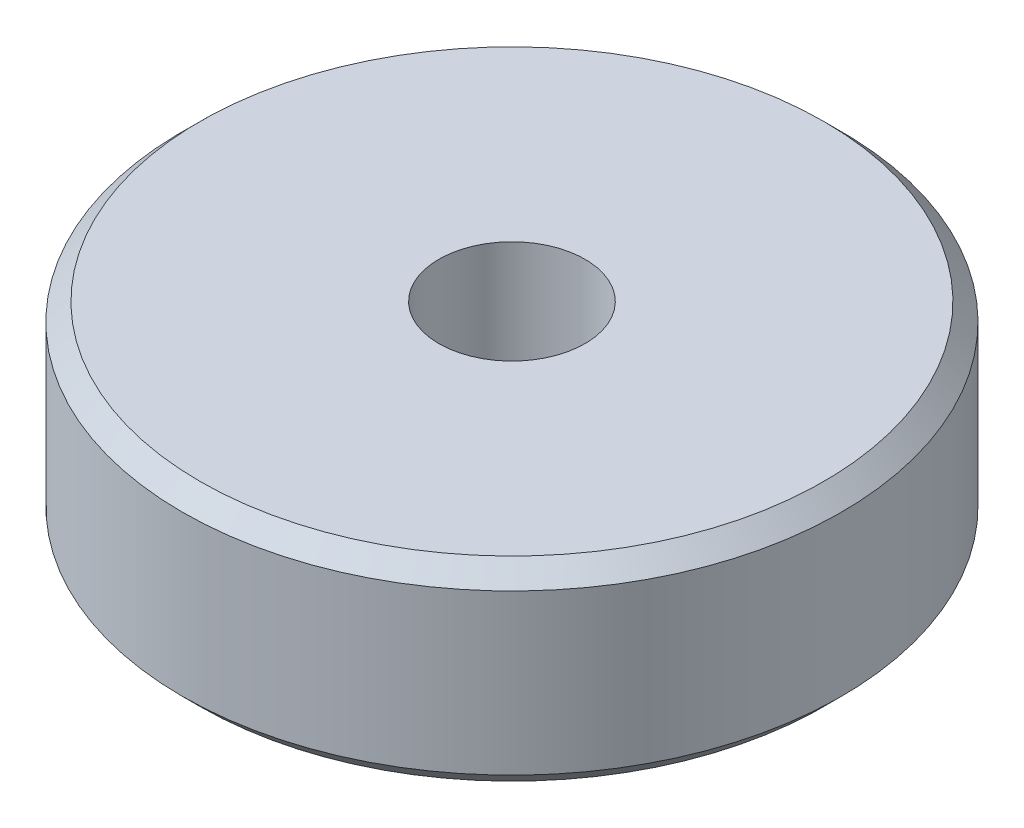
ISO-10303-21;
HEADER;
FILE_DESCRIPTION(('STEP AP214'),'2;1');
FILE_NAME('part.step','',(''),(''),'','','');
FILE_SCHEMA(('AUTOMOTIVE_DESIGN { 1 0 10303 214 1 1 1 1 }'));
ENDSEC;
DATA;
#1=APPLICATION_CONTEXT('core data for automotive mechanical design processes');
#2=APPLICATION_PROTOCOL_DEFINITION('international standard','automotive_design',2000,#1);
#3=PRODUCT_CONTEXT('',#1,'mechanical');
#4=PRODUCT('Part','Part','',(#3));
#5=PRODUCT_RELATED_PRODUCT_CATEGORY('part','',(#4));
#6=PRODUCT_DEFINITION_FORMATION('','',#4);
#7=PRODUCT_DEFINITION_CONTEXT('part definition',#1,'design');
#8=PRODUCT_DEFINITION('design','',#6,#7);
#9=PRODUCT_DEFINITION_SHAPE('','',#8);
#10=(LENGTH_UNIT() NAMED_UNIT(*) SI_UNIT(.MILLI.,.METRE.));
#11=(NAMED_UNIT(*) PLANE_ANGLE_UNIT() SI_UNIT($,.RADIAN.));
#12=(NAMED_UNIT(*) SI_UNIT($,.STERADIAN.) SOLID_ANGLE_UNIT());
#13=UNCERTAINTY_MEASURE_WITH_UNIT(LENGTH_MEASURE(1.E-05),#10,'distance_accuracy_value','');
#14=(GEOMETRIC_REPRESENTATION_CONTEXT(3) GLOBAL_UNCERTAINTY_ASSIGNED_CONTEXT((#13)) GLOBAL_UNIT_ASSIGNED_CONTEXT((#10,
#11,#12)) REPRESENTATION_CONTEXT('',''));
#15=CARTESIAN_POINT('',(0.,0.,0.));
#16=DIRECTION('',(0.,0.,1.));
#17=DIRECTION('',(1.,0.,0.));
#18=AXIS2_PLACEMENT_3D('',#15,#16,#17);
#19=CARTESIAN_POINT('',(0.,11.,0.));
#20=DIRECTION('',(0.,-1.,0.));
#21=DIRECTION('',(0.,0.,-1.));
#22=AXIS2_PLACEMENT_3D('',#19,#20,#21);
#23=CYLINDRICAL_SURFACE('',#22,18.595);
#24=CARTESIAN_POINT('',(0.,1.,0.));
#25=DIRECTION('',(0.,1.,0.));
#26=DIRECTION('',(0.,0.,1.));
#27=AXIS2_PLACEMENT_3D('',#24,#25,#26);
#28=CIRCLE('',#27,18.595);
#29=CARTESIAN_POINT('',(0.,1.,18.595));
#30=VERTEX_POINT('',#29);
#31=EDGE_CURVE('E41',#30,#30,#28,.T.);
#32=ORIENTED_EDGE('',*,*,#31,.T.);
#33=EDGE_LOOP('',(#32));
#34=FACE_BOUND('',#33,.T.);
#35=CARTESIAN_POINT('',(0.,10.,0.));
#36=DIRECTION('',(0.,1.,0.));
#37=DIRECTION('',(0.,0.,1.));
#38=AXIS2_PLACEMENT_3D('',#35,#36,#37);
#39=CIRCLE('',#38,18.595);
#40=CARTESIAN_POINT('',(0.,10.,18.595));
#41=VERTEX_POINT('',#40);
#42=EDGE_CURVE('E45',#41,#41,#39,.F.);
#43=ORIENTED_EDGE('',*,*,#42,.T.);
#44=EDGE_LOOP('',(#43));
#45=FACE_BOUND('',#44,.T.);
#46=ADVANCED_FACE('F30',(#34,#45),#23,.T.);
#47=CARTESIAN_POINT('',(0.,11.,0.));
#48=DIRECTION('',(0.,1.,0.));
#49=DIRECTION('',(0.,0.,1.));
#50=AXIS2_PLACEMENT_3D('',#47,#48,#49);
#51=PLANE('',#50);
#52=CARTESIAN_POINT('',(0.,11.,0.));
#53=DIRECTION('',(0.,1.,0.));
#54=DIRECTION('',(0.,0.,1.));
#55=AXIS2_PLACEMENT_3D('',#52,#53,#54);
#56=CIRCLE('',#55,17.595);
#57=CARTESIAN_POINT('',(0.,11.,17.595));
#58=VERTEX_POINT('',#57);
#59=EDGE_CURVE('E10',#58,#58,#56,.T.);
#60=ORIENTED_EDGE('',*,*,#59,.T.);
#61=EDGE_LOOP('',(#60));
#62=FACE_BOUND('',#61,.T.);
#63=CARTESIAN_POINT('',(0.,11.,0.));
#64=DIRECTION('',(0.,1.,0.));
#65=DIRECTION('',(0.,0.,1.));
#66=AXIS2_PLACEMENT_3D('',#63,#64,#65);
#67=CIRCLE('',#66,4.125);
#68=CARTESIAN_POINT('',(0.,11.,4.125));
#69=VERTEX_POINT('',#68);
#70=EDGE_CURVE('E51',#69,#69,#67,.T.);
#71=ORIENTED_EDGE('',*,*,#70,.F.);
#72=EDGE_LOOP('',(#71));
#73=FACE_BOUND('',#72,.T.);
#74=ADVANCED_FACE('F66',(#62,#73),#51,.T.);
#75=CARTESIAN_POINT('',(0.,0.,0.));
#76=DIRECTION('',(0.,1.,0.));
#77=DIRECTION('',(0.,0.,1.));
#78=AXIS2_PLACEMENT_3D('',#75,#76,#77);
#79=PLANE('',#78);
#80=CARTESIAN_POINT('',(0.,0.,0.));
#81=DIRECTION('',(0.,1.,0.));
#82=DIRECTION('',(0.,0.,1.));
#83=AXIS2_PLACEMENT_3D('',#80,#81,#82);
#84=CIRCLE('',#83,17.595);
#85=CARTESIAN_POINT('',(0.,0.,17.595));
#86=VERTEX_POINT('',#85);
#87=EDGE_CURVE('E37',#86,#86,#84,.F.);
#88=ORIENTED_EDGE('',*,*,#87,.T.);
#89=EDGE_LOOP('',(#88));
#90=FACE_BOUND('',#89,.T.);
#91=CARTESIAN_POINT('',(0.,0.,0.));
#92=DIRECTION('',(0.,1.,0.));
#93=DIRECTION('',(0.,0.,1.));
#94=AXIS2_PLACEMENT_3D('',#91,#92,#93);
#95=CIRCLE('',#94,4.125);
#96=CARTESIAN_POINT('',(0.,0.,4.125));
#97=VERTEX_POINT('',#96);
#98=EDGE_CURVE('E50',#97,#97,#95,.T.);
#99=ORIENTED_EDGE('',*,*,#98,.T.);
#100=EDGE_LOOP('',(#99));
#101=FACE_BOUND('',#100,.T.);
#102=ADVANCED_FACE('F57',(#90,#101),#79,.F.);
#103=CARTESIAN_POINT('',(0.,0.,0.));
#104=DIRECTION('',(0.,1.,0.));
#105=DIRECTION('',(0.,0.,1.));
#106=AXIS2_PLACEMENT_3D('',#103,#104,#105);
#107=CYLINDRICAL_SURFACE('',#106,4.125);
#108=ORIENTED_EDGE('',*,*,#98,.F.);
#109=EDGE_LOOP('',(#108));
#110=FACE_BOUND('',#109,.T.);
#111=ORIENTED_EDGE('',*,*,#70,.T.);
#112=EDGE_LOOP('',(#111));
#113=FACE_BOUND('',#112,.T.);
#114=ADVANCED_FACE('F59',(#110,#113),#107,.F.);
#115=CARTESIAN_POINT('',(0.,1.,0.));
#116=DIRECTION('',(0.,1.,0.));
#117=DIRECTION('',(0.,0.,1.));
#118=AXIS2_PLACEMENT_3D('',#115,#116,#117);
#119=CONICAL_SURFACE('',#118,18.595,0.785398163397448);
#120=ORIENTED_EDGE('',*,*,#87,.F.);
#121=EDGE_LOOP('',(#120));
#122=FACE_BOUND('',#121,.T.);
#123=ORIENTED_EDGE('',*,*,#31,.F.);
#124=EDGE_LOOP('',(#123));
#125=FACE_BOUND('',#124,.T.);
#126=ADVANCED_FACE('F62',(#122,#125),#119,.T.);
#127=CARTESIAN_POINT('',(0.,11.,0.));
#128=DIRECTION('',(0.,-1.,0.));
#129=DIRECTION('',(0.,0.,-1.));
#130=AXIS2_PLACEMENT_3D('',#127,#128,#129);
#131=CONICAL_SURFACE('',#130,17.595,0.785398163397445);
#132=ORIENTED_EDGE('',*,*,#42,.F.);
#133=EDGE_LOOP('',(#132));
#134=FACE_BOUND('',#133,.T.);
#135=ORIENTED_EDGE('',*,*,#59,.F.);
#136=EDGE_LOOP('',(#135));
#137=FACE_BOUND('',#136,.T.);
#138=ADVANCED_FACE('F32',(#134,#137),#131,.T.);
#139=CLOSED_SHELL('',(#46,#74,#102,#114,#126,#138));
#140=MANIFOLD_SOLID_BREP('B2',#139);
#141=ADVANCED_BREP_SHAPE_REPRESENTATION('',(#18,#140),#14);
#142=SHAPE_DEFINITION_REPRESENTATION(#9,#141);
ENDSEC;
END-ISO-10303-21;
